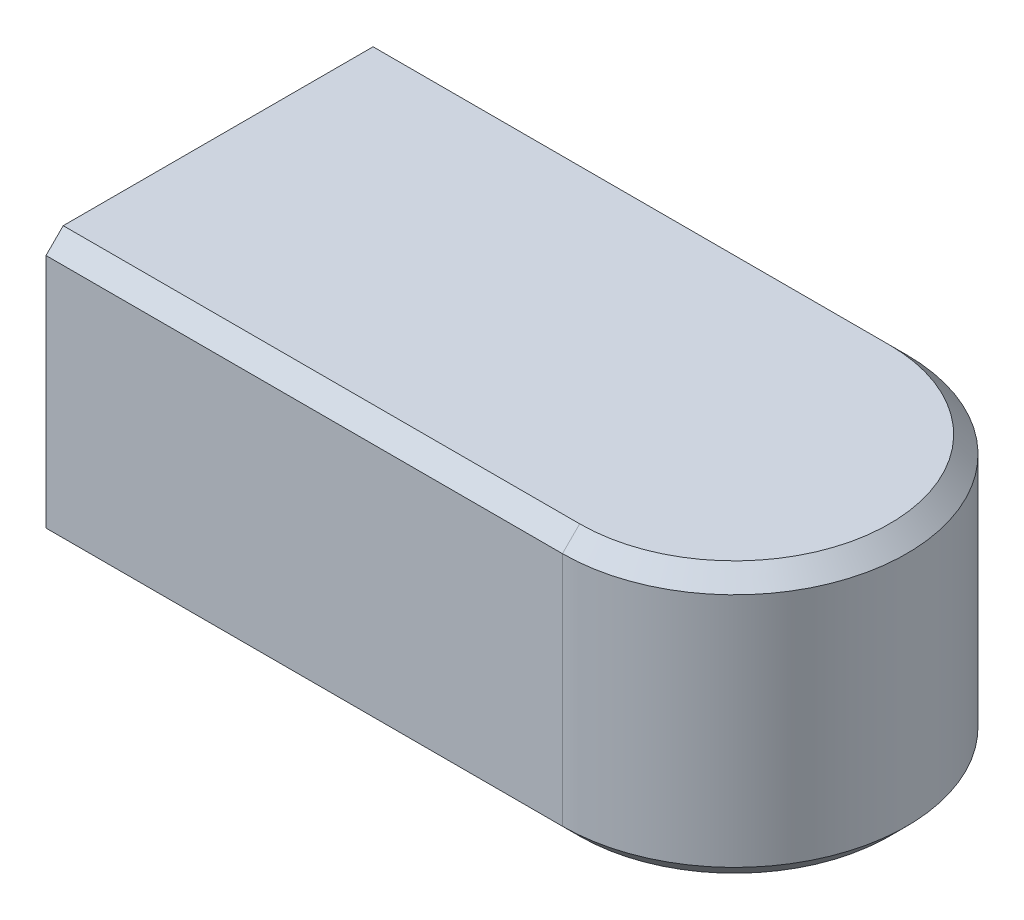
ISO-10303-21;
HEADER;
FILE_DESCRIPTION(('STEP AP214'),'2;1');
FILE_NAME('part.step','',(''),(''),'','','');
FILE_SCHEMA(('AUTOMOTIVE_DESIGN { 1 0 10303 214 1 1 1 1 }'));
ENDSEC;
DATA;
#1=APPLICATION_CONTEXT('core data for automotive mechanical design processes');
#2=APPLICATION_PROTOCOL_DEFINITION('international standard','automotive_design',2000,#1);
#3=PRODUCT_CONTEXT('',#1,'mechanical');
#4=PRODUCT('Part','Part','',(#3));
#5=PRODUCT_RELATED_PRODUCT_CATEGORY('part','',(#4));
#6=PRODUCT_DEFINITION_FORMATION('','',#4);
#7=PRODUCT_DEFINITION_CONTEXT('part definition',#1,'design');
#8=PRODUCT_DEFINITION('design','',#6,#7);
#9=PRODUCT_DEFINITION_SHAPE('','',#8);
#10=(LENGTH_UNIT() NAMED_UNIT(*) SI_UNIT(.MILLI.,.METRE.));
#11=(NAMED_UNIT(*) PLANE_ANGLE_UNIT() SI_UNIT($,.RADIAN.));
#12=(NAMED_UNIT(*) SI_UNIT($,.STERADIAN.) SOLID_ANGLE_UNIT());
#13=UNCERTAINTY_MEASURE_WITH_UNIT(LENGTH_MEASURE(1.E-05),#10,'distance_accuracy_value','');
#14=(GEOMETRIC_REPRESENTATION_CONTEXT(3) GLOBAL_UNCERTAINTY_ASSIGNED_CONTEXT((#13)) GLOBAL_UNIT_ASSIGNED_CONTEXT((#10,
#11,#12)) REPRESENTATION_CONTEXT('',''));
#15=CARTESIAN_POINT('',(0.,0.,0.));
#16=DIRECTION('',(0.,0.,1.));
#17=DIRECTION('',(1.,0.,0.));
#18=AXIS2_PLACEMENT_3D('',#15,#16,#17);
#19=CARTESIAN_POINT('',(-10.5,10.65,6.65));
#20=DIRECTION('',(0.,0.707106781186548,0.707106781186548));
#21=DIRECTION('',(0.,-0.707106781186548,0.707106781186548));
#22=AXIS2_PLACEMENT_3D('',#19,#20,#21);
#23=PLANE('',#22);
#24=DIRECTION('',(1.,0.,0.));
#25=VECTOR('',#24,1.);
#26=CARTESIAN_POINT('',(0.,11.,6.3));
#27=LINE('',#26,#25);
#28=CARTESIAN_POINT('',(-21.,11.,6.3));
#29=VERTEX_POINT('',#28);
#30=CARTESIAN_POINT('',(0.,11.0000009966029,6.3000004982945));
#31=VERTEX_POINT('',#30);
#32=EDGE_CURVE('E78',#29,#31,#27,.T.);
#33=ORIENTED_EDGE('',*,*,#32,.F.);
#34=DIRECTION('',(0.,-0.707106781186548,0.707106781186548));
#35=VECTOR('',#34,1.);
#36=CARTESIAN_POINT('',(-21.,10.65,6.65));
#37=LINE('',#36,#35);
#38=CARTESIAN_POINT('',(-21.,10.3,7.));
#39=VERTEX_POINT('',#38);
#40=EDGE_CURVE('E161',#29,#39,#37,.T.);
#41=ORIENTED_EDGE('',*,*,#40,.T.);
#42=DIRECTION('',(1.,0.,0.));
#43=VECTOR('',#42,1.);
#44=CARTESIAN_POINT('',(-21.,10.3,7.));
#45=LINE('',#44,#43);
#46=CARTESIAN_POINT('',(0.,10.3000002768206,7.0000002768287));
#47=VERTEX_POINT('',#46);
#48=EDGE_CURVE('E111',#47,#39,#45,.F.);
#49=ORIENTED_EDGE('',*,*,#48,.F.);
#50=DIRECTION('',(0.,0.707106669334584,-0.707106893038494));
#51=VECTOR('',#50,1.);
#52=CARTESIAN_POINT('',(-2.71289327282261E-10,-498982.542133838,499000.));
#53=LINE('',#52,#51);
#54=EDGE_CURVE('E97',#31,#47,#53,.F.);
#55=ORIENTED_EDGE('',*,*,#54,.F.);
#56=EDGE_LOOP('',(#33,#41,#49,#55));
#57=FACE_BOUND('',#56,.T.);
#58=ADVANCED_FACE('F17',(#57),#23,.T.);
#59=CARTESIAN_POINT('',(0.,10.3000011072822,0.));
#60=DIRECTION('',(0.,-1.,0.));
#61=DIRECTION('',(0.,0.,-1.));
#62=AXIS2_PLACEMENT_3D('',#59,#60,#61);
#63=CONICAL_SURFACE('',#62,7.0000011073148,0.78539832154396);
#64=DIRECTION('',(0.,0.707106781186548,0.707106781186548));
#65=VECTOR('',#64,1.);
#66=CARTESIAN_POINT('',(0.,10.65,-6.65));
#67=LINE('',#66,#65);
#68=CARTESIAN_POINT('',(0.,11.0000004983015,-6.30000049829451));
#69=VERTEX_POINT('',#68);
#70=CARTESIAN_POINT('',(0.,10.3,-7.));
#71=VERTEX_POINT('',#70);
#72=EDGE_CURVE('E89',#69,#71,#67,.F.);
#73=ORIENTED_EDGE('',*,*,#72,.F.);
#74=CARTESIAN_POINT('',(0.,11.0000009966029,0.));
#75=DIRECTION('',(0.,-1.,0.));
#76=DIRECTION('',(0.,0.,-1.));
#77=AXIS2_PLACEMENT_3D('',#74,#75,#76);
#78=CIRCLE('',#77,6.30000099658901);
#79=EDGE_CURVE('E20',#31,#69,#78,.F.);
#80=ORIENTED_EDGE('',*,*,#79,.F.);
#81=ORIENTED_EDGE('',*,*,#54,.T.);
#82=CARTESIAN_POINT('',(0.,10.3,0.));
#83=DIRECTION('',(0.,1.,0.));
#84=DIRECTION('',(0.,0.,1.));
#85=AXIS2_PLACEMENT_3D('',#82,#83,#84);
#86=CIRCLE('',#85,7.);
#87=EDGE_CURVE('E92',#71,#47,#86,.F.);
#88=ORIENTED_EDGE('',*,*,#87,.F.);
#89=EDGE_LOOP('',(#73,#80,#81,#88));
#90=FACE_BOUND('',#89,.T.);
#91=ADVANCED_FACE('F90',(#90),#63,.T.);
#92=CARTESIAN_POINT('',(-10.5,10.65,-6.65));
#93=DIRECTION('',(0.,0.707106781186548,-0.707106781186548));
#94=DIRECTION('',(0.,0.707106781186548,0.707106781186548));
#95=AXIS2_PLACEMENT_3D('',#92,#93,#94);
#96=PLANE('',#95);
#97=DIRECTION('',(-1.,0.,0.));
#98=VECTOR('',#97,1.);
#99=CARTESIAN_POINT('',(0.,10.3,-7.));
#100=LINE('',#99,#98);
#101=CARTESIAN_POINT('',(-21.,10.3,-7.));
#102=VERTEX_POINT('',#101);
#103=EDGE_CURVE('E134',#102,#71,#100,.F.);
#104=ORIENTED_EDGE('',*,*,#103,.F.);
#105=DIRECTION('',(0.,0.707106781186548,0.707106781186548));
#106=VECTOR('',#105,1.);
#107=CARTESIAN_POINT('',(-21.,10.65,-6.65));
#108=LINE('',#107,#106);
#109=CARTESIAN_POINT('',(-21.,11.,-6.3));
#110=VERTEX_POINT('',#109);
#111=EDGE_CURVE('E96',#102,#110,#108,.T.);
#112=ORIENTED_EDGE('',*,*,#111,.T.);
#113=DIRECTION('',(1.,0.,0.));
#114=VECTOR('',#113,1.);
#115=CARTESIAN_POINT('',(0.,11.,-6.3));
#116=LINE('',#115,#114);
#117=EDGE_CURVE('E85',#69,#110,#116,.F.);
#118=ORIENTED_EDGE('',*,*,#117,.F.);
#119=ORIENTED_EDGE('',*,*,#72,.T.);
#120=EDGE_LOOP('',(#104,#112,#118,#119));
#121=FACE_BOUND('',#120,.T.);
#122=ADVANCED_FACE('F99',(#121),#96,.T.);
#123=CARTESIAN_POINT('',(0.,0.,0.));
#124=DIRECTION('',(0.,1.,0.));
#125=DIRECTION('',(0.,0.,1.));
#126=AXIS2_PLACEMENT_3D('',#123,#124,#125);
#127=CYLINDRICAL_SURFACE('',#126,7.);
#128=DIRECTION('',(0.,1.,0.));
#129=VECTOR('',#128,1.);
#130=CARTESIAN_POINT('',(0.,0.,-7.));
#131=LINE('',#130,#129);
#132=CARTESIAN_POINT('',(0.,0.699999723171254,-7.0000002768287));
#133=VERTEX_POINT('',#132);
#134=EDGE_CURVE('E137',#71,#133,#131,.F.);
#135=ORIENTED_EDGE('',*,*,#134,.F.);
#136=ORIENTED_EDGE('',*,*,#87,.T.);
#137=DIRECTION('',(0.,1.,0.));
#138=VECTOR('',#137,1.);
#139=CARTESIAN_POINT('',(0.,0.,7.));
#140=LINE('',#139,#138);
#141=CARTESIAN_POINT('',(0.,0.699999446328297,7.00000055364319));
#142=VERTEX_POINT('',#141);
#143=EDGE_CURVE('E136',#142,#47,#140,.T.);
#144=ORIENTED_EDGE('',*,*,#143,.F.);
#145=CARTESIAN_POINT('',(0.,0.699998892685016,0.));
#146=DIRECTION('',(0.,1.,0.));
#147=DIRECTION('',(-1.,0.,2.47234416787478E-10));
#148=AXIS2_PLACEMENT_3D('',#145,#146,#147);
#149=CIRCLE('',#148,7.0000011073148);
#150=EDGE_CURVE('E102',#133,#142,#149,.F.);
#151=ORIENTED_EDGE('',*,*,#150,.F.);
#152=EDGE_LOOP('',(#135,#136,#144,#151));
#153=FACE_BOUND('',#152,.T.);
#154=ADVANCED_FACE('F242',(#153),#127,.T.);
#155=CARTESIAN_POINT('',(0.,0.,-7.));
#156=DIRECTION('',(0.,0.,-1.));
#157=DIRECTION('',(-1.,0.,0.));
#158=AXIS2_PLACEMENT_3D('',#155,#156,#157);
#159=PLANE('',#158);
#160=DIRECTION('',(0.,1.,0.));
#161=VECTOR('',#160,1.);
#162=CARTESIAN_POINT('',(-21.,0.,-7.));
#163=LINE('',#162,#161);
#164=CARTESIAN_POINT('',(-21.,0.7,-7.));
#165=VERTEX_POINT('',#164);
#166=EDGE_CURVE('E130',#102,#165,#163,.F.);
#167=ORIENTED_EDGE('',*,*,#166,.F.);
#168=ORIENTED_EDGE('',*,*,#103,.T.);
#169=ORIENTED_EDGE('',*,*,#134,.T.);
#170=DIRECTION('',(1.,0.,0.));
#171=VECTOR('',#170,1.);
#172=CARTESIAN_POINT('',(-10.5,0.7,-7.));
#173=LINE('',#172,#171);
#174=EDGE_CURVE('E123',#165,#133,#173,.T.);
#175=ORIENTED_EDGE('',*,*,#174,.F.);
#176=EDGE_LOOP('',(#167,#168,#169,#175));
#177=FACE_BOUND('',#176,.T.);
#178=ADVANCED_FACE('F213',(#177),#159,.T.);
#179=CARTESIAN_POINT('',(-21.,0.,7.));
#180=DIRECTION('',(0.,0.,1.));
#181=DIRECTION('',(1.,0.,0.));
#182=AXIS2_PLACEMENT_3D('',#179,#180,#181);
#183=PLANE('',#182);
#184=ORIENTED_EDGE('',*,*,#143,.T.);
#185=ORIENTED_EDGE('',*,*,#48,.T.);
#186=DIRECTION('',(0.,1.,0.));
#187=VECTOR('',#186,1.);
#188=CARTESIAN_POINT('',(-21.,0.,7.));
#189=LINE('',#188,#187);
#190=CARTESIAN_POINT('',(-21.,0.7,7.));
#191=VERTEX_POINT('',#190);
#192=EDGE_CURVE('E116',#191,#39,#189,.T.);
#193=ORIENTED_EDGE('',*,*,#192,.F.);
#194=DIRECTION('',(1.,0.,0.));
#195=VECTOR('',#194,1.);
#196=CARTESIAN_POINT('',(-10.5,0.7,7.));
#197=LINE('',#196,#195);
#198=EDGE_CURVE('E100',#142,#191,#197,.F.);
#199=ORIENTED_EDGE('',*,*,#198,.F.);
#200=EDGE_LOOP('',(#184,#185,#193,#199));
#201=FACE_BOUND('',#200,.T.);
#202=ADVANCED_FACE('F206',(#201),#183,.T.);
#203=CARTESIAN_POINT('',(0.,11.,0.));
#204=DIRECTION('',(0.,1.,0.));
#205=DIRECTION('',(0.,0.,1.));
#206=AXIS2_PLACEMENT_3D('',#203,#204,#205);
#207=PLANE('',#206);
#208=ORIENTED_EDGE('',*,*,#79,.T.);
#209=ORIENTED_EDGE('',*,*,#117,.T.);
#210=DIRECTION('',(0.,0.,1.));
#211=VECTOR('',#210,1.);
#212=CARTESIAN_POINT('',(-21.,11.,-7.));
#213=LINE('',#212,#211);
#214=EDGE_CURVE('E119',#29,#110,#213,.F.);
#215=ORIENTED_EDGE('',*,*,#214,.F.);
#216=ORIENTED_EDGE('',*,*,#32,.T.);
#217=EDGE_LOOP('',(#208,#209,#215,#216));
#218=FACE_BOUND('',#217,.T.);
#219=ADVANCED_FACE('F83',(#218),#207,.T.);
#220=CARTESIAN_POINT('',(-10.5,0.35,6.65));
#221=DIRECTION('',(0.,-0.707106781186548,0.707106781186548));
#222=DIRECTION('',(0.,-0.707106781186548,-0.707106781186548));
#223=AXIS2_PLACEMENT_3D('',#220,#221,#222);
#224=PLANE('',#223);
#225=ORIENTED_EDGE('',*,*,#198,.T.);
#226=DIRECTION('',(0.,0.707106781186547,0.707106781186548));
#227=VECTOR('',#226,1.);
#228=CARTESIAN_POINT('',(-21.,0.,6.3));
#229=LINE('',#228,#227);
#230=CARTESIAN_POINT('',(-21.,0.,6.3));
#231=VERTEX_POINT('',#230);
#232=EDGE_CURVE('E120',#231,#191,#229,.T.);
#233=ORIENTED_EDGE('',*,*,#232,.F.);
#234=DIRECTION('',(1.,0.,0.));
#235=VECTOR('',#234,1.);
#236=CARTESIAN_POINT('',(0.,0.,6.3));
#237=LINE('',#236,#235);
#238=CARTESIAN_POINT('',(0.,-9.96578820226628E-07,6.30000049829451));
#239=VERTEX_POINT('',#238);
#240=EDGE_CURVE('E157',#231,#239,#237,.T.);
#241=ORIENTED_EDGE('',*,*,#240,.T.);
#242=DIRECTION('',(0.,-0.707106669334584,-0.707106893038494));
#243=VECTOR('',#242,1.);
#244=CARTESIAN_POINT('',(-4.96896884522205E-11,498993.542133838,499000.));
#245=LINE('',#244,#243);
#246=EDGE_CURVE('E127',#142,#239,#245,.T.);
#247=ORIENTED_EDGE('',*,*,#246,.F.);
#248=EDGE_LOOP('',(#225,#233,#241,#247));
#249=FACE_BOUND('',#248,.T.);
#250=ADVANCED_FACE('F233',(#249),#224,.T.);
#251=CARTESIAN_POINT('',(0.,0.699998892628173,0.));
#252=DIRECTION('',(0.,1.,0.));
#253=DIRECTION('',(0.,0.,1.));
#254=AXIS2_PLACEMENT_3D('',#251,#252,#253);
#255=CONICAL_SURFACE('',#254,7.00000110725796,0.785398321584563);
#256=ORIENTED_EDGE('',*,*,#246,.T.);
#257=CARTESIAN_POINT('',(0.,-9.96578820226628E-07,0.));
#258=DIRECTION('',(0.,1.,0.));
#259=DIRECTION('',(0.,0.,1.));
#260=AXIS2_PLACEMENT_3D('',#257,#258,#259);
#261=CIRCLE('',#260,6.30000099658901);
#262=CARTESIAN_POINT('',(0.,-4.98289410004894E-07,-6.3000004982945));
#263=VERTEX_POINT('',#262);
#264=EDGE_CURVE('E173',#239,#263,#261,.T.);
#265=ORIENTED_EDGE('',*,*,#264,.T.);
#266=DIRECTION('',(0.,0.707106781186548,-0.707106781186548));
#267=VECTOR('',#266,1.);
#268=CARTESIAN_POINT('',(0.,0.350000000000001,-6.65));
#269=LINE('',#268,#267);
#270=EDGE_CURVE('E126',#133,#263,#269,.F.);
#271=ORIENTED_EDGE('',*,*,#270,.F.);
#272=ORIENTED_EDGE('',*,*,#150,.T.);
#273=EDGE_LOOP('',(#256,#265,#271,#272));
#274=FACE_BOUND('',#273,.T.);
#275=ADVANCED_FACE('F230',(#274),#255,.T.);
#276=CARTESIAN_POINT('',(-10.5,0.35,-6.65));
#277=DIRECTION('',(0.,-0.707106781186548,-0.707106781186548));
#278=DIRECTION('',(0.,0.707106781186548,-0.707106781186548));
#279=AXIS2_PLACEMENT_3D('',#276,#277,#278);
#280=PLANE('',#279);
#281=DIRECTION('',(1.,0.,0.));
#282=VECTOR('',#281,1.);
#283=CARTESIAN_POINT('',(0.,0.,-6.3));
#284=LINE('',#283,#282);
#285=CARTESIAN_POINT('',(-21.,0.,-6.3));
#286=VERTEX_POINT('',#285);
#287=EDGE_CURVE('E26',#263,#286,#284,.F.);
#288=ORIENTED_EDGE('',*,*,#287,.T.);
#289=DIRECTION('',(0.,-0.707106781186547,0.707106781186548));
#290=VECTOR('',#289,1.);
#291=CARTESIAN_POINT('',(-21.,0.7,-7.));
#292=LINE('',#291,#290);
#293=EDGE_CURVE('E34',#165,#286,#292,.T.);
#294=ORIENTED_EDGE('',*,*,#293,.F.);
#295=ORIENTED_EDGE('',*,*,#174,.T.);
#296=ORIENTED_EDGE('',*,*,#270,.T.);
#297=EDGE_LOOP('',(#288,#294,#295,#296));
#298=FACE_BOUND('',#297,.T.);
#299=ADVANCED_FACE('F216',(#298),#280,.T.);
#300=CARTESIAN_POINT('',(-21.,0.,-7.));
#301=DIRECTION('',(-1.,0.,0.));
#302=DIRECTION('',(0.,0.,1.));
#303=AXIS2_PLACEMENT_3D('',#300,#301,#302);
#304=PLANE('',#303);
#305=ORIENTED_EDGE('',*,*,#214,.T.);
#306=ORIENTED_EDGE('',*,*,#111,.F.);
#307=ORIENTED_EDGE('',*,*,#166,.T.);
#308=ORIENTED_EDGE('',*,*,#293,.T.);
#309=DIRECTION('',(0.,0.,1.));
#310=VECTOR('',#309,1.);
#311=CARTESIAN_POINT('',(-21.,0.,0.));
#312=LINE('',#311,#310);
#313=EDGE_CURVE('E11',#286,#231,#312,.T.);
#314=ORIENTED_EDGE('',*,*,#313,.T.);
#315=ORIENTED_EDGE('',*,*,#232,.T.);
#316=ORIENTED_EDGE('',*,*,#192,.T.);
#317=ORIENTED_EDGE('',*,*,#40,.F.);
#318=EDGE_LOOP('',(#305,#306,#307,#308,#314,#315,#316,#317));
#319=FACE_BOUND('',#318,.T.);
#320=ADVANCED_FACE('F203',(#319),#304,.T.);
#321=CARTESIAN_POINT('',(0.,0.,0.));
#322=DIRECTION('',(0.,1.,0.));
#323=DIRECTION('',(0.,0.,1.));
#324=AXIS2_PLACEMENT_3D('',#321,#322,#323);
#325=PLANE('',#324);
#326=ORIENTED_EDGE('',*,*,#287,.F.);
#327=ORIENTED_EDGE('',*,*,#264,.F.);
#328=ORIENTED_EDGE('',*,*,#240,.F.);
#329=ORIENTED_EDGE('',*,*,#313,.F.);
#330=EDGE_LOOP('',(#326,#327,#328,#329));
#331=FACE_BOUND('',#330,.T.);
#332=ADVANCED_FACE('F219',(#331),#325,.F.);
#333=CLOSED_SHELL('',(#58,#91,#122,#154,#178,#202,#219,#250,#275,#299,#320,#332));
#334=MANIFOLD_SOLID_BREP('B1',#333);
#335=ADVANCED_BREP_SHAPE_REPRESENTATION('',(#18,#334),#14);
#336=SHAPE_DEFINITION_REPRESENTATION(#9,#335);
ENDSEC;
END-ISO-10303-21;
